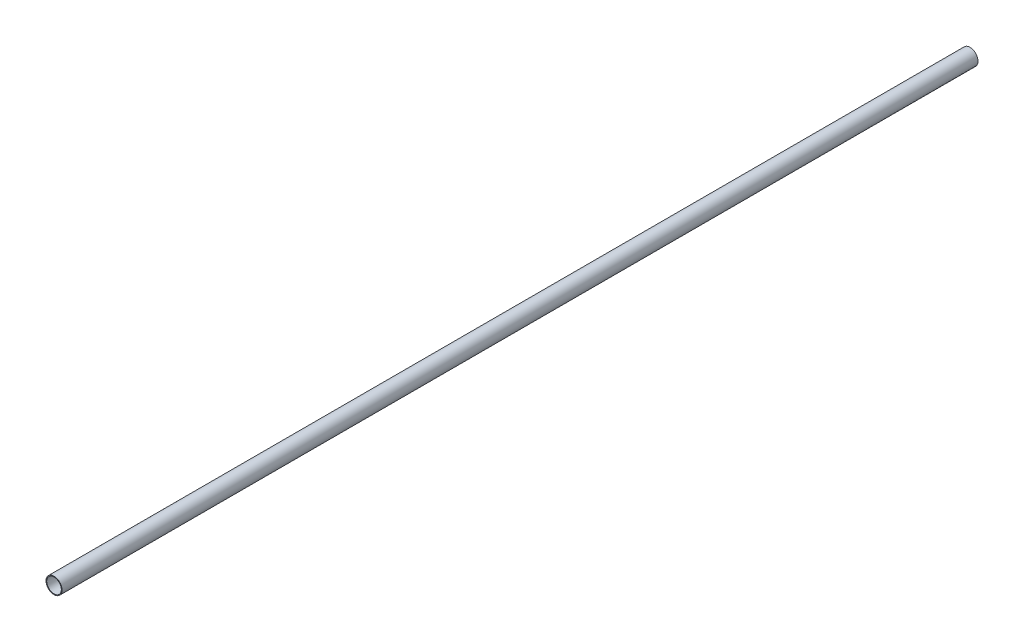
ISO-10303-21;
HEADER;
FILE_DESCRIPTION(('STEP AP214'),'2;1');
FILE_NAME('part.step','',(''),(''),'','','');
FILE_SCHEMA(('AUTOMOTIVE_DESIGN { 1 0 10303 214 1 1 1 1 }'));
ENDSEC;
DATA;
#1=APPLICATION_CONTEXT('core data for automotive mechanical design processes');
#2=APPLICATION_PROTOCOL_DEFINITION('international standard','automotive_design',2000,#1);
#3=PRODUCT_CONTEXT('',#1,'mechanical');
#4=PRODUCT('Part','Part','',(#3));
#5=PRODUCT_RELATED_PRODUCT_CATEGORY('part','',(#4));
#6=PRODUCT_DEFINITION_FORMATION('','',#4);
#7=PRODUCT_DEFINITION_CONTEXT('part definition',#1,'design');
#8=PRODUCT_DEFINITION('design','',#6,#7);
#9=PRODUCT_DEFINITION_SHAPE('','',#8);
#10=(LENGTH_UNIT() NAMED_UNIT(*) SI_UNIT(.MILLI.,.METRE.));
#11=(NAMED_UNIT(*) PLANE_ANGLE_UNIT() SI_UNIT($,.RADIAN.));
#12=(NAMED_UNIT(*) SI_UNIT($,.STERADIAN.) SOLID_ANGLE_UNIT());
#13=UNCERTAINTY_MEASURE_WITH_UNIT(LENGTH_MEASURE(1.E-05),#10,'distance_accuracy_value','');
#14=(GEOMETRIC_REPRESENTATION_CONTEXT(3) GLOBAL_UNCERTAINTY_ASSIGNED_CONTEXT((#13)) GLOBAL_UNIT_ASSIGNED_CONTEXT((#10,
#11,#12)) REPRESENTATION_CONTEXT('',''));
#15=CARTESIAN_POINT('',(0.,0.,0.));
#16=DIRECTION('',(0.,0.,1.));
#17=DIRECTION('',(1.,0.,0.));
#18=AXIS2_PLACEMENT_3D('',#15,#16,#17);
#19=CARTESIAN_POINT('',(0.,0.,314.));
#20=DIRECTION('',(0.,0.,1.));
#21=DIRECTION('',(1.,0.,0.));
#22=AXIS2_PLACEMENT_3D('',#19,#20,#21);
#23=PLANE('',#22);
#24=CARTESIAN_POINT('',(0.,0.,314.));
#25=DIRECTION('',(0.,0.,1.));
#26=DIRECTION('',(1.,0.,0.));
#27=AXIS2_PLACEMENT_3D('',#24,#25,#26);
#28=CIRCLE('',#27,2.75);
#29=CARTESIAN_POINT('',(2.75,0.,314.));
#30=VERTEX_POINT('',#29);
#31=EDGE_CURVE('E10',#30,#30,#28,.T.);
#32=ORIENTED_EDGE('',*,*,#31,.T.);
#33=EDGE_LOOP('',(#32));
#34=FACE_BOUND('',#33,.T.);
#35=CARTESIAN_POINT('',(0.,0.,314.));
#36=DIRECTION('',(0.,0.,1.));
#37=DIRECTION('',(1.,0.,0.));
#38=AXIS2_PLACEMENT_3D('',#35,#36,#37);
#39=CIRCLE('',#38,2.5);
#40=CARTESIAN_POINT('',(2.5,0.,314.));
#41=VERTEX_POINT('',#40);
#42=EDGE_CURVE('E50',#41,#41,#39,.T.);
#43=ORIENTED_EDGE('',*,*,#42,.F.);
#44=EDGE_LOOP('',(#43));
#45=FACE_BOUND('',#44,.T.);
#46=ADVANCED_FACE('F37',(#34,#45),#23,.T.);
#47=CARTESIAN_POINT('',(0.,0.,0.));
#48=DIRECTION('',(0.,0.,1.));
#49=DIRECTION('',(1.,0.,0.));
#50=AXIS2_PLACEMENT_3D('',#47,#48,#49);
#51=PLANE('',#50);
#52=CARTESIAN_POINT('',(0.,0.,0.));
#53=DIRECTION('',(0.,0.,1.));
#54=DIRECTION('',(1.,0.,0.));
#55=AXIS2_PLACEMENT_3D('',#52,#53,#54);
#56=CIRCLE('',#55,2.75);
#57=CARTESIAN_POINT('',(2.75,0.,0.));
#58=VERTEX_POINT('',#57);
#59=EDGE_CURVE('E41',#58,#58,#56,.T.);
#60=ORIENTED_EDGE('',*,*,#59,.F.);
#61=EDGE_LOOP('',(#60));
#62=FACE_BOUND('',#61,.T.);
#63=CARTESIAN_POINT('',(0.,0.,0.));
#64=DIRECTION('',(0.,0.,1.));
#65=DIRECTION('',(1.,0.,0.));
#66=AXIS2_PLACEMENT_3D('',#63,#64,#65);
#67=CIRCLE('',#66,2.5);
#68=CARTESIAN_POINT('',(2.5,0.,0.));
#69=VERTEX_POINT('',#68);
#70=EDGE_CURVE('E52',#69,#69,#67,.T.);
#71=ORIENTED_EDGE('',*,*,#70,.T.);
#72=EDGE_LOOP('',(#71));
#73=FACE_BOUND('',#72,.T.);
#74=ADVANCED_FACE('F64',(#62,#73),#51,.F.);
#75=CARTESIAN_POINT('',(0.,0.,314.));
#76=DIRECTION('',(0.,0.,-1.));
#77=DIRECTION('',(-1.,0.,0.));
#78=AXIS2_PLACEMENT_3D('',#75,#76,#77);
#79=CYLINDRICAL_SURFACE('',#78,2.75);
#80=ORIENTED_EDGE('',*,*,#31,.F.);
#81=EDGE_LOOP('',(#80));
#82=FACE_BOUND('',#81,.T.);
#83=ORIENTED_EDGE('',*,*,#59,.T.);
#84=EDGE_LOOP('',(#83));
#85=FACE_BOUND('',#84,.T.);
#86=ADVANCED_FACE('F39',(#82,#85),#79,.T.);
#87=CARTESIAN_POINT('',(0.,0.,314.));
#88=DIRECTION('',(0.,0.,-1.));
#89=DIRECTION('',(-1.,0.,0.));
#90=AXIS2_PLACEMENT_3D('',#87,#88,#89);
#91=CYLINDRICAL_SURFACE('',#90,2.5);
#92=ORIENTED_EDGE('',*,*,#42,.T.);
#93=EDGE_LOOP('',(#92));
#94=FACE_BOUND('',#93,.T.);
#95=ORIENTED_EDGE('',*,*,#70,.F.);
#96=EDGE_LOOP('',(#95));
#97=FACE_BOUND('',#96,.T.);
#98=ADVANCED_FACE('F60',(#94,#97),#91,.F.);
#99=CLOSED_SHELL('',(#46,#74,#86,#98));
#100=MANIFOLD_SOLID_BREP('B2',#99);
#101=ADVANCED_BREP_SHAPE_REPRESENTATION('',(#18,#100),#14);
#102=SHAPE_DEFINITION_REPRESENTATION(#9,#101);
ENDSEC;
END-ISO-10303-21;
